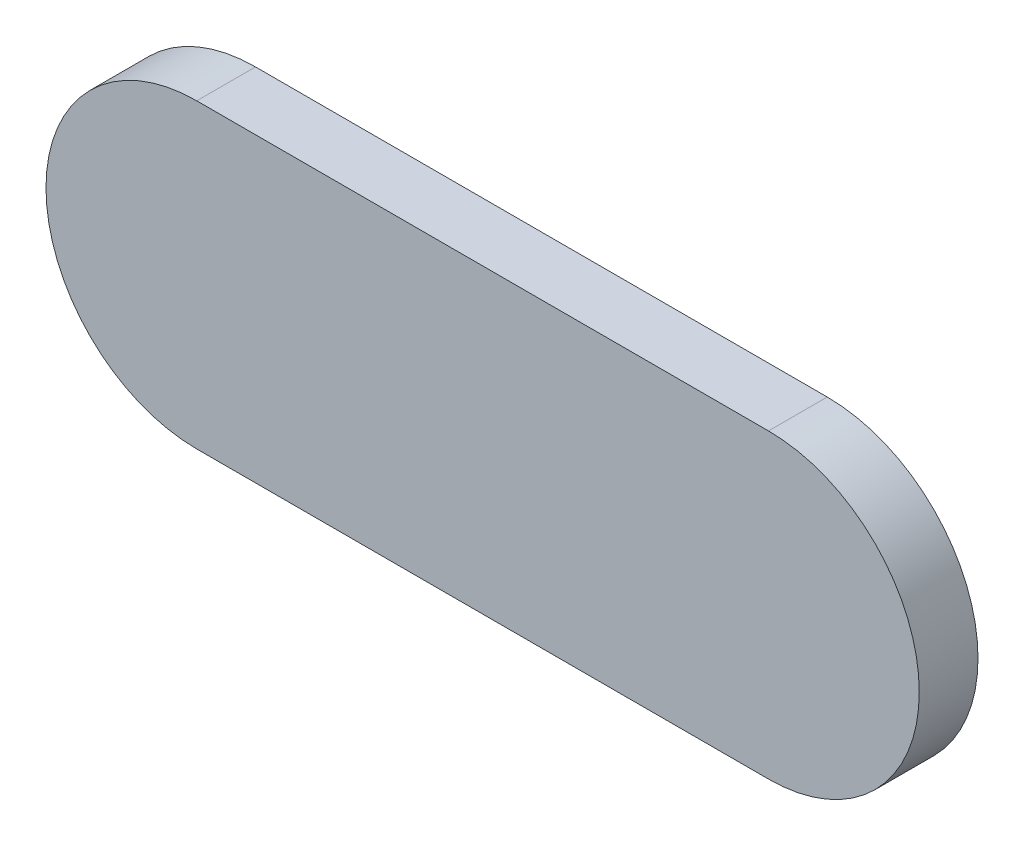
ISO-10303-21;
HEADER;
FILE_DESCRIPTION(('STEP AP214'),'2;1');
FILE_NAME('part.step','',(''),(''),'','','');
FILE_SCHEMA(('AUTOMOTIVE_DESIGN { 1 0 10303 214 1 1 1 1 }'));
ENDSEC;
DATA;
#1=APPLICATION_CONTEXT('core data for automotive mechanical design processes');
#2=APPLICATION_PROTOCOL_DEFINITION('international standard','automotive_design',2000,#1);
#3=PRODUCT_CONTEXT('',#1,'mechanical');
#4=PRODUCT('Part','Part','',(#3));
#5=PRODUCT_RELATED_PRODUCT_CATEGORY('part','',(#4));
#6=PRODUCT_DEFINITION_FORMATION('','',#4);
#7=PRODUCT_DEFINITION_CONTEXT('part definition',#1,'design');
#8=PRODUCT_DEFINITION('design','',#6,#7);
#9=PRODUCT_DEFINITION_SHAPE('','',#8);
#10=(LENGTH_UNIT() NAMED_UNIT(*) SI_UNIT(.MILLI.,.METRE.));
#11=(NAMED_UNIT(*) PLANE_ANGLE_UNIT() SI_UNIT($,.RADIAN.));
#12=(NAMED_UNIT(*) SI_UNIT($,.STERADIAN.) SOLID_ANGLE_UNIT());
#13=UNCERTAINTY_MEASURE_WITH_UNIT(LENGTH_MEASURE(1.E-05),#10,'distance_accuracy_value','');
#14=(GEOMETRIC_REPRESENTATION_CONTEXT(3) GLOBAL_UNCERTAINTY_ASSIGNED_CONTEXT((#13)) GLOBAL_UNIT_ASSIGNED_CONTEXT((#10,
#11,#12)) REPRESENTATION_CONTEXT('',''));
#15=CARTESIAN_POINT('',(0.,0.,0.));
#16=DIRECTION('',(0.,0.,1.));
#17=DIRECTION('',(1.,0.,0.));
#18=AXIS2_PLACEMENT_3D('',#15,#16,#17);
#19=CARTESIAN_POINT('',(7.3,0.,0.));
#20=DIRECTION('',(0.,0.,1.));
#21=DIRECTION('',(1.,0.,0.));
#22=AXIS2_PLACEMENT_3D('',#19,#20,#21);
#23=PLANE('',#22);
#24=CARTESIAN_POINT('',(7.3,0.,0.));
#25=DIRECTION('',(0.,0.,1.));
#26=DIRECTION('',(1.,0.,0.));
#27=AXIS2_PLACEMENT_3D('',#24,#25,#26);
#28=CIRCLE('',#27,3.85);
#29=CARTESIAN_POINT('',(7.3,-3.85,0.));
#30=VERTEX_POINT('',#29);
#31=CARTESIAN_POINT('',(7.3,3.85,0.));
#32=VERTEX_POINT('',#31);
#33=EDGE_CURVE('E121',#30,#32,#28,.T.);
#34=ORIENTED_EDGE('',*,*,#33,.F.);
#35=DIRECTION('',(1.,0.,0.));
#36=VECTOR('',#35,1.);
#37=CARTESIAN_POINT('',(-7.3,-3.85,0.));
#38=LINE('',#37,#36);
#39=CARTESIAN_POINT('',(-7.3,-3.85,0.));
#40=VERTEX_POINT('',#39);
#41=EDGE_CURVE('E134',#40,#30,#38,.T.);
#42=ORIENTED_EDGE('',*,*,#41,.F.);
#43=CARTESIAN_POINT('',(-7.3,0.,0.));
#44=DIRECTION('',(0.,0.,1.));
#45=DIRECTION('',(1.,0.,0.));
#46=AXIS2_PLACEMENT_3D('',#43,#44,#45);
#47=CIRCLE('',#46,3.85);
#48=CARTESIAN_POINT('',(-7.3,3.85,0.));
#49=VERTEX_POINT('',#48);
#50=EDGE_CURVE('E142',#49,#40,#47,.T.);
#51=ORIENTED_EDGE('',*,*,#50,.F.);
#52=DIRECTION('',(-1.,0.,0.));
#53=VECTOR('',#52,1.);
#54=CARTESIAN_POINT('',(7.3,3.85,0.));
#55=LINE('',#54,#53);
#56=EDGE_CURVE('E124',#32,#49,#55,.T.);
#57=ORIENTED_EDGE('',*,*,#56,.F.);
#58=EDGE_LOOP('',(#34,#42,#51,#57));
#59=FACE_BOUND('',#58,.T.);
#60=CARTESIAN_POINT('',(7.35,0.,0.));
#61=DIRECTION('',(0.,0.,-1.));
#62=DIRECTION('',(1.,0.,0.));
#63=AXIS2_PLACEMENT_3D('',#60,#61,#62);
#64=CIRCLE('',#63,2.3);
#65=CARTESIAN_POINT('',(7.35,2.3,0.));
#66=VERTEX_POINT('',#65);
#67=CARTESIAN_POINT('',(7.35,-2.3,0.));
#68=VERTEX_POINT('',#67);
#69=EDGE_CURVE('E51',#66,#68,#64,.T.);
#70=ORIENTED_EDGE('',*,*,#69,.F.);
#71=DIRECTION('',(1.,0.,0.));
#72=VECTOR('',#71,1.);
#73=CARTESIAN_POINT('',(7.35,2.3,0.));
#74=LINE('',#73,#72);
#75=CARTESIAN_POINT('',(-7.35,2.3,0.));
#76=VERTEX_POINT('',#75);
#77=EDGE_CURVE('E55',#76,#66,#74,.T.);
#78=ORIENTED_EDGE('',*,*,#77,.F.);
#79=CARTESIAN_POINT('',(-7.35,0.,0.));
#80=DIRECTION('',(0.,0.,-1.));
#81=DIRECTION('',(-1.,0.,0.));
#82=AXIS2_PLACEMENT_3D('',#79,#80,#81);
#83=CIRCLE('',#82,2.3);
#84=CARTESIAN_POINT('',(-7.35,-2.3,0.));
#85=VERTEX_POINT('',#84);
#86=EDGE_CURVE('E456',#85,#76,#83,.T.);
#87=ORIENTED_EDGE('',*,*,#86,.F.);
#88=DIRECTION('',(-1.,0.,0.));
#89=VECTOR('',#88,1.);
#90=CARTESIAN_POINT('',(7.35,-2.3,0.));
#91=LINE('',#90,#89);
#92=EDGE_CURVE('E458',#68,#85,#91,.T.);
#93=ORIENTED_EDGE('',*,*,#92,.F.);
#94=EDGE_LOOP('',(#70,#78,#87,#93));
#95=FACE_BOUND('',#94,.T.);
#96=ADVANCED_FACE('F36',(#59,#95),#23,.F.);
#97=CARTESIAN_POINT('',(7.3,0.,1.5));
#98=DIRECTION('',(0.,0.,-1.));
#99=DIRECTION('',(-1.,0.,0.));
#100=AXIS2_PLACEMENT_3D('',#97,#98,#99);
#101=CYLINDRICAL_SURFACE('',#100,3.85);
#102=ORIENTED_EDGE('',*,*,#33,.T.);
#103=DIRECTION('',(0.,0.,-1.));
#104=VECTOR('',#103,1.);
#105=CARTESIAN_POINT('',(7.3,3.85,1.5));
#106=LINE('',#105,#104);
#107=CARTESIAN_POINT('',(7.3,3.85,1.5));
#108=VERTEX_POINT('',#107);
#109=EDGE_CURVE('E153',#108,#32,#106,.T.);
#110=ORIENTED_EDGE('',*,*,#109,.F.);
#111=CARTESIAN_POINT('',(7.3,0.,1.5));
#112=DIRECTION('',(0.,0.,1.));
#113=DIRECTION('',(1.,0.,0.));
#114=AXIS2_PLACEMENT_3D('',#111,#112,#113);
#115=CIRCLE('',#114,3.85);
#116=CARTESIAN_POINT('',(7.3,-3.85,1.5));
#117=VERTEX_POINT('',#116);
#118=EDGE_CURVE('E130',#117,#108,#115,.T.);
#119=ORIENTED_EDGE('',*,*,#118,.F.);
#120=DIRECTION('',(0.,0.,-1.));
#121=VECTOR('',#120,1.);
#122=CARTESIAN_POINT('',(7.3,-3.85,1.5));
#123=LINE('',#122,#121);
#124=EDGE_CURVE('E139',#117,#30,#123,.T.);
#125=ORIENTED_EDGE('',*,*,#124,.T.);
#126=EDGE_LOOP('',(#102,#110,#119,#125));
#127=FACE_BOUND('',#126,.T.);
#128=ADVANCED_FACE('F200',(#127),#101,.T.);
#129=CARTESIAN_POINT('',(7.3,3.85,1.5));
#130=DIRECTION('',(0.,-1.,0.));
#131=DIRECTION('',(1.,0.,0.));
#132=AXIS2_PLACEMENT_3D('',#129,#130,#131);
#133=PLANE('',#132);
#134=ORIENTED_EDGE('',*,*,#56,.T.);
#135=DIRECTION('',(0.,0.,-1.));
#136=VECTOR('',#135,1.);
#137=CARTESIAN_POINT('',(-7.3,3.85,1.5));
#138=LINE('',#137,#136);
#139=CARTESIAN_POINT('',(-7.3,3.85,1.5));
#140=VERTEX_POINT('',#139);
#141=EDGE_CURVE('E150',#140,#49,#138,.T.);
#142=ORIENTED_EDGE('',*,*,#141,.F.);
#143=DIRECTION('',(-1.,0.,0.));
#144=VECTOR('',#143,1.);
#145=CARTESIAN_POINT('',(7.3,3.85,1.5));
#146=LINE('',#145,#144);
#147=EDGE_CURVE('E133',#108,#140,#146,.T.);
#148=ORIENTED_EDGE('',*,*,#147,.F.);
#149=ORIENTED_EDGE('',*,*,#109,.T.);
#150=EDGE_LOOP('',(#134,#142,#148,#149));
#151=FACE_BOUND('',#150,.T.);
#152=ADVANCED_FACE('F206',(#151),#133,.F.);
#153=CARTESIAN_POINT('',(-7.3,0.,1.5));
#154=DIRECTION('',(0.,0.,-1.));
#155=DIRECTION('',(-1.,0.,0.));
#156=AXIS2_PLACEMENT_3D('',#153,#154,#155);
#157=CYLINDRICAL_SURFACE('',#156,3.85);
#158=ORIENTED_EDGE('',*,*,#50,.T.);
#159=DIRECTION('',(0.,0.,-1.));
#160=VECTOR('',#159,1.);
#161=CARTESIAN_POINT('',(-7.3,-3.85,1.5));
#162=LINE('',#161,#160);
#163=CARTESIAN_POINT('',(-7.3,-3.85,1.5));
#164=VERTEX_POINT('',#163);
#165=EDGE_CURVE('E147',#164,#40,#162,.T.);
#166=ORIENTED_EDGE('',*,*,#165,.F.);
#167=CARTESIAN_POINT('',(-7.3,0.,1.5));
#168=DIRECTION('',(0.,0.,1.));
#169=DIRECTION('',(1.,0.,0.));
#170=AXIS2_PLACEMENT_3D('',#167,#168,#169);
#171=CIRCLE('',#170,3.85);
#172=EDGE_CURVE('E136',#140,#164,#171,.T.);
#173=ORIENTED_EDGE('',*,*,#172,.F.);
#174=ORIENTED_EDGE('',*,*,#141,.T.);
#175=EDGE_LOOP('',(#158,#166,#173,#174));
#176=FACE_BOUND('',#175,.T.);
#177=ADVANCED_FACE('F217',(#176),#157,.T.);
#178=CARTESIAN_POINT('',(-7.3,-3.85,1.5));
#179=DIRECTION('',(0.,1.,0.));
#180=DIRECTION('',(0.,0.,1.));
#181=AXIS2_PLACEMENT_3D('',#178,#179,#180);
#182=PLANE('',#181);
#183=ORIENTED_EDGE('',*,*,#41,.T.);
#184=ORIENTED_EDGE('',*,*,#124,.F.);
#185=DIRECTION('',(1.,0.,0.));
#186=VECTOR('',#185,1.);
#187=CARTESIAN_POINT('',(-7.3,-3.85,1.5));
#188=LINE('',#187,#186);
#189=EDGE_CURVE('E138',#164,#117,#188,.T.);
#190=ORIENTED_EDGE('',*,*,#189,.F.);
#191=ORIENTED_EDGE('',*,*,#165,.T.);
#192=EDGE_LOOP('',(#183,#184,#190,#191));
#193=FACE_BOUND('',#192,.T.);
#194=ADVANCED_FACE('F214',(#193),#182,.F.);
#195=CARTESIAN_POINT('',(7.3,0.,1.5));
#196=DIRECTION('',(0.,0.,1.));
#197=DIRECTION('',(1.,0.,0.));
#198=AXIS2_PLACEMENT_3D('',#195,#196,#197);
#199=PLANE('',#198);
#200=ORIENTED_EDGE('',*,*,#118,.T.);
#201=ORIENTED_EDGE('',*,*,#147,.T.);
#202=ORIENTED_EDGE('',*,*,#172,.T.);
#203=ORIENTED_EDGE('',*,*,#189,.T.);
#204=EDGE_LOOP('',(#200,#201,#202,#203));
#205=FACE_BOUND('',#204,.T.);
#206=ADVANCED_FACE('F212',(#205),#199,.T.);
#207=CARTESIAN_POINT('',(7.35,0.,-0.5));
#208=DIRECTION('',(0.,0.,1.));
#209=DIRECTION('',(1.,0.,0.));
#210=AXIS2_PLACEMENT_3D('',#207,#208,#209);
#211=CYLINDRICAL_SURFACE('',#210,2.3);
#212=ORIENTED_EDGE('',*,*,#69,.T.);
#213=DIRECTION('',(0.,0.,1.));
#214=VECTOR('',#213,1.);
#215=CARTESIAN_POINT('',(7.35,-2.3,-0.5));
#216=LINE('',#215,#214);
#217=CARTESIAN_POINT('',(7.35,-2.3,-0.5));
#218=VERTEX_POINT('',#217);
#219=EDGE_CURVE('E104',#218,#68,#216,.T.);
#220=ORIENTED_EDGE('',*,*,#219,.F.);
#221=CARTESIAN_POINT('',(7.35,0.,-0.5));
#222=DIRECTION('',(0.,0.,-1.));
#223=DIRECTION('',(1.,0.,0.));
#224=AXIS2_PLACEMENT_3D('',#221,#222,#223);
#225=CIRCLE('',#224,2.3);
#226=CARTESIAN_POINT('',(7.35,2.3,-0.5));
#227=VERTEX_POINT('',#226);
#228=EDGE_CURVE('E110',#227,#218,#225,.T.);
#229=ORIENTED_EDGE('',*,*,#228,.F.);
#230=DIRECTION('',(0.,0.,1.));
#231=VECTOR('',#230,1.);
#232=CARTESIAN_POINT('',(7.35,2.3,-0.5));
#233=LINE('',#232,#231);
#234=EDGE_CURVE('E460',#227,#66,#233,.T.);
#235=ORIENTED_EDGE('',*,*,#234,.T.);
#236=EDGE_LOOP('',(#212,#220,#229,#235));
#237=FACE_BOUND('',#236,.T.);
#238=ADVANCED_FACE('F120',(#237),#211,.T.);
#239=CARTESIAN_POINT('',(7.35,-2.3,-0.5));
#240=DIRECTION('',(0.,1.,0.));
#241=DIRECTION('',(0.,0.,1.));
#242=AXIS2_PLACEMENT_3D('',#239,#240,#241);
#243=PLANE('',#242);
#244=ORIENTED_EDGE('',*,*,#92,.T.);
#245=DIRECTION('',(0.,0.,1.));
#246=VECTOR('',#245,1.);
#247=CARTESIAN_POINT('',(-7.35,-2.3,-0.5));
#248=LINE('',#247,#246);
#249=CARTESIAN_POINT('',(-7.35,-2.3,-0.5));
#250=VERTEX_POINT('',#249);
#251=EDGE_CURVE('E106',#250,#85,#248,.T.);
#252=ORIENTED_EDGE('',*,*,#251,.F.);
#253=DIRECTION('',(-1.,0.,0.));
#254=VECTOR('',#253,1.);
#255=CARTESIAN_POINT('',(7.35,-2.3,-0.5));
#256=LINE('',#255,#254);
#257=EDGE_CURVE('E99',#218,#250,#256,.T.);
#258=ORIENTED_EDGE('',*,*,#257,.F.);
#259=ORIENTED_EDGE('',*,*,#219,.T.);
#260=EDGE_LOOP('',(#244,#252,#258,#259));
#261=FACE_BOUND('',#260,.T.);
#262=ADVANCED_FACE('F102',(#261),#243,.F.);
#263=CARTESIAN_POINT('',(-7.35,0.,-0.5));
#264=DIRECTION('',(0.,0.,1.));
#265=DIRECTION('',(1.,0.,0.));
#266=AXIS2_PLACEMENT_3D('',#263,#264,#265);
#267=CYLINDRICAL_SURFACE('',#266,2.3);
#268=ORIENTED_EDGE('',*,*,#86,.T.);
#269=DIRECTION('',(0.,0.,1.));
#270=VECTOR('',#269,1.);
#271=CARTESIAN_POINT('',(-7.35,2.3,-0.5));
#272=LINE('',#271,#270);
#273=CARTESIAN_POINT('',(-7.35,2.3,-0.5));
#274=VERTEX_POINT('',#273);
#275=EDGE_CURVE('E126',#274,#76,#272,.T.);
#276=ORIENTED_EDGE('',*,*,#275,.F.);
#277=CARTESIAN_POINT('',(-7.35,0.,-0.5));
#278=DIRECTION('',(0.,0.,-1.));
#279=DIRECTION('',(-1.,0.,0.));
#280=AXIS2_PLACEMENT_3D('',#277,#278,#279);
#281=CIRCLE('',#280,2.3);
#282=EDGE_CURVE('E109',#250,#274,#281,.T.);
#283=ORIENTED_EDGE('',*,*,#282,.F.);
#284=ORIENTED_EDGE('',*,*,#251,.T.);
#285=EDGE_LOOP('',(#268,#276,#283,#284));
#286=FACE_BOUND('',#285,.T.);
#287=ADVANCED_FACE('F260',(#286),#267,.T.);
#288=CARTESIAN_POINT('',(7.35,2.3,-0.5));
#289=DIRECTION('',(0.,-1.,0.));
#290=DIRECTION('',(0.,0.,-1.));
#291=AXIS2_PLACEMENT_3D('',#288,#289,#290);
#292=PLANE('',#291);
#293=ORIENTED_EDGE('',*,*,#77,.T.);
#294=ORIENTED_EDGE('',*,*,#234,.F.);
#295=DIRECTION('',(1.,0.,0.));
#296=VECTOR('',#295,1.);
#297=CARTESIAN_POINT('',(7.35,2.3,-0.5));
#298=LINE('',#297,#296);
#299=EDGE_CURVE('E115',#274,#227,#298,.T.);
#300=ORIENTED_EDGE('',*,*,#299,.F.);
#301=ORIENTED_EDGE('',*,*,#275,.T.);
#302=EDGE_LOOP('',(#293,#294,#300,#301));
#303=FACE_BOUND('',#302,.T.);
#304=ADVANCED_FACE('F256',(#303),#292,.F.);
#305=CARTESIAN_POINT('',(7.35,0.,-0.5));
#306=DIRECTION('',(0.,0.,1.));
#307=DIRECTION('',(1.,0.,0.));
#308=AXIS2_PLACEMENT_3D('',#305,#306,#307);
#309=PLANE('',#308);
#310=CARTESIAN_POINT('',(1.27,0.,-0.5));
#311=DIRECTION('',(0.,0.,1.));
#312=DIRECTION('',(1.,0.,0.));
#313=AXIS2_PLACEMENT_3D('',#310,#311,#312);
#314=CIRCLE('',#313,0.75);
#315=CARTESIAN_POINT('',(2.02,0.,-0.5));
#316=VERTEX_POINT('',#315);
#317=EDGE_CURVE('E165',#316,#316,#314,.F.);
#318=ORIENTED_EDGE('',*,*,#317,.F.);
#319=EDGE_LOOP('',(#318));
#320=FACE_BOUND('',#319,.T.);
#321=CARTESIAN_POINT('',(3.81,0.,-0.5));
#322=DIRECTION('',(0.,0.,1.));
#323=DIRECTION('',(1.,0.,0.));
#324=AXIS2_PLACEMENT_3D('',#321,#322,#323);
#325=CIRCLE('',#324,0.750000000000001);
#326=CARTESIAN_POINT('',(4.56,0.,-0.5));
#327=VERTEX_POINT('',#326);
#328=EDGE_CURVE('E162',#327,#327,#325,.F.);
#329=ORIENTED_EDGE('',*,*,#328,.F.);
#330=EDGE_LOOP('',(#329));
#331=FACE_BOUND('',#330,.T.);
#332=CARTESIAN_POINT('',(-3.81,0.,-0.5));
#333=DIRECTION('',(0.,0.,1.));
#334=DIRECTION('',(1.,0.,0.));
#335=AXIS2_PLACEMENT_3D('',#332,#333,#334);
#336=CIRCLE('',#335,0.750000000000001);
#337=CARTESIAN_POINT('',(-3.06,0.,-0.5));
#338=VERTEX_POINT('',#337);
#339=EDGE_CURVE('E159',#338,#338,#336,.F.);
#340=ORIENTED_EDGE('',*,*,#339,.F.);
#341=EDGE_LOOP('',(#340));
#342=FACE_BOUND('',#341,.T.);
#343=CARTESIAN_POINT('',(-1.27,0.,-0.5));
#344=DIRECTION('',(0.,0.,1.));
#345=DIRECTION('',(1.,0.,0.));
#346=AXIS2_PLACEMENT_3D('',#343,#344,#345);
#347=CIRCLE('',#346,0.75);
#348=CARTESIAN_POINT('',(-0.52,0.,-0.5));
#349=VERTEX_POINT('',#348);
#350=EDGE_CURVE('E156',#349,#349,#347,.F.);
#351=ORIENTED_EDGE('',*,*,#350,.F.);
#352=EDGE_LOOP('',(#351));
#353=FACE_BOUND('',#352,.T.);
#354=ORIENTED_EDGE('',*,*,#228,.T.);
#355=ORIENTED_EDGE('',*,*,#257,.T.);
#356=ORIENTED_EDGE('',*,*,#282,.T.);
#357=ORIENTED_EDGE('',*,*,#299,.T.);
#358=EDGE_LOOP('',(#354,#355,#356,#357));
#359=FACE_BOUND('',#358,.T.);
#360=ADVANCED_FACE('F113',(#320,#331,#342,#353,#359),#309,.F.);
#361=CARTESIAN_POINT('',(-1.27,0.,-1.5));
#362=DIRECTION('',(0.,0.,1.));
#363=DIRECTION('',(1.,0.,0.));
#364=AXIS2_PLACEMENT_3D('',#361,#362,#363);
#365=CYLINDRICAL_SURFACE('',#364,0.75);
#366=CARTESIAN_POINT('',(-1.27,0.,-1.));
#367=DIRECTION('',(0.,0.,-1.));
#368=DIRECTION('',(-1.,0.,0.));
#369=AXIS2_PLACEMENT_3D('',#366,#367,#368);
#370=CIRCLE('',#369,0.75);
#371=CARTESIAN_POINT('',(-2.02,0.,-1.));
#372=VERTEX_POINT('',#371);
#373=EDGE_CURVE('E177',#372,#372,#370,.F.);
#374=ORIENTED_EDGE('',*,*,#373,.T.);
#375=EDGE_LOOP('',(#374));
#376=FACE_BOUND('',#375,.T.);
#377=ORIENTED_EDGE('',*,*,#350,.T.);
#378=EDGE_LOOP('',(#377));
#379=FACE_BOUND('',#378,.T.);
#380=ADVANCED_FACE('F241',(#376,#379),#365,.T.);
#381=CARTESIAN_POINT('',(-1.27,0.,-1.5));
#382=DIRECTION('',(0.,0.,-1.));
#383=DIRECTION('',(-1.,0.,0.));
#384=AXIS2_PLACEMENT_3D('',#381,#382,#383);
#385=PLANE('',#384);
#386=CARTESIAN_POINT('',(-1.27,0.,-1.5));
#387=DIRECTION('',(0.,0.,-1.));
#388=DIRECTION('',(-1.,0.,0.));
#389=AXIS2_PLACEMENT_3D('',#386,#387,#388);
#390=CIRCLE('',#389,0.25);
#391=CARTESIAN_POINT('',(-1.52,0.,-1.5));
#392=VERTEX_POINT('',#391);
#393=EDGE_CURVE('E174',#392,#392,#390,.T.);
#394=ORIENTED_EDGE('',*,*,#393,.T.);
#395=EDGE_LOOP('',(#394));
#396=FACE_BOUND('',#395,.T.);
#397=ADVANCED_FACE('F238',(#396),#385,.T.);
#398=CARTESIAN_POINT('',(-3.81,0.,-1.5));
#399=DIRECTION('',(0.,0.,1.));
#400=DIRECTION('',(1.,0.,0.));
#401=AXIS2_PLACEMENT_3D('',#398,#399,#400);
#402=CYLINDRICAL_SURFACE('',#401,0.750000000000001);
#403=CARTESIAN_POINT('',(-3.81,0.,-1.));
#404=DIRECTION('',(0.,0.,-1.));
#405=DIRECTION('',(-1.,0.,0.));
#406=AXIS2_PLACEMENT_3D('',#403,#404,#405);
#407=CIRCLE('',#406,0.750000000000001);
#408=CARTESIAN_POINT('',(-4.56,0.,-1.));
#409=VERTEX_POINT('',#408);
#410=EDGE_CURVE('E171',#409,#409,#407,.F.);
#411=ORIENTED_EDGE('',*,*,#410,.T.);
#412=EDGE_LOOP('',(#411));
#413=FACE_BOUND('',#412,.T.);
#414=ORIENTED_EDGE('',*,*,#339,.T.);
#415=EDGE_LOOP('',(#414));
#416=FACE_BOUND('',#415,.T.);
#417=ADVANCED_FACE('F240',(#413,#416),#402,.T.);
#418=CARTESIAN_POINT('',(-3.81,0.,-1.5));
#419=DIRECTION('',(0.,0.,-1.));
#420=DIRECTION('',(-1.,0.,0.));
#421=AXIS2_PLACEMENT_3D('',#418,#419,#420);
#422=PLANE('',#421);
#423=CARTESIAN_POINT('',(-3.81,0.,-1.5));
#424=DIRECTION('',(0.,0.,-1.));
#425=DIRECTION('',(-1.,0.,0.));
#426=AXIS2_PLACEMENT_3D('',#423,#424,#425);
#427=CIRCLE('',#426,0.250000000000001);
#428=CARTESIAN_POINT('',(-4.06,0.,-1.5));
#429=VERTEX_POINT('',#428);
#430=EDGE_CURVE('E168',#429,#429,#427,.T.);
#431=ORIENTED_EDGE('',*,*,#430,.T.);
#432=EDGE_LOOP('',(#431));
#433=FACE_BOUND('',#432,.T.);
#434=ADVANCED_FACE('F247',(#433),#422,.T.);
#435=CARTESIAN_POINT('',(3.81,0.,-1.5));
#436=DIRECTION('',(0.,0.,1.));
#437=DIRECTION('',(1.,0.,0.));
#438=AXIS2_PLACEMENT_3D('',#435,#436,#437);
#439=CYLINDRICAL_SURFACE('',#438,0.750000000000001);
#440=CARTESIAN_POINT('',(3.81,0.,-1.));
#441=DIRECTION('',(0.,0.,1.));
#442=DIRECTION('',(1.,0.,0.));
#443=AXIS2_PLACEMENT_3D('',#440,#441,#442);
#444=CIRCLE('',#443,0.750000000000001);
#445=CARTESIAN_POINT('',(4.56,0.,-1.));
#446=VERTEX_POINT('',#445);
#447=EDGE_CURVE('E11',#446,#446,#444,.T.);
#448=ORIENTED_EDGE('',*,*,#447,.T.);
#449=EDGE_LOOP('',(#448));
#450=FACE_BOUND('',#449,.T.);
#451=ORIENTED_EDGE('',*,*,#328,.T.);
#452=EDGE_LOOP('',(#451));
#453=FACE_BOUND('',#452,.T.);
#454=ADVANCED_FACE('F360',(#450,#453),#439,.T.);
#455=CARTESIAN_POINT('',(3.81,0.,-1.5));
#456=DIRECTION('',(0.,0.,1.));
#457=DIRECTION('',(1.,0.,0.));
#458=AXIS2_PLACEMENT_3D('',#455,#456,#457);
#459=PLANE('',#458);
#460=CARTESIAN_POINT('',(3.81,0.,-1.5));
#461=DIRECTION('',(0.,0.,1.));
#462=DIRECTION('',(1.,0.,0.));
#463=AXIS2_PLACEMENT_3D('',#460,#461,#462);
#464=CIRCLE('',#463,0.250000000000001);
#465=CARTESIAN_POINT('',(4.06,0.,-1.5));
#466=VERTEX_POINT('',#465);
#467=EDGE_CURVE('E44',#466,#466,#464,.F.);
#468=ORIENTED_EDGE('',*,*,#467,.T.);
#469=EDGE_LOOP('',(#468));
#470=FACE_BOUND('',#469,.T.);
#471=ADVANCED_FACE('F188',(#470),#459,.F.);
#472=CARTESIAN_POINT('',(1.27,0.,-1.5));
#473=DIRECTION('',(0.,0.,1.));
#474=DIRECTION('',(1.,0.,0.));
#475=AXIS2_PLACEMENT_3D('',#472,#473,#474);
#476=CYLINDRICAL_SURFACE('',#475,0.75);
#477=CARTESIAN_POINT('',(1.27,0.,-1.));
#478=DIRECTION('',(0.,0.,1.));
#479=DIRECTION('',(1.,0.,0.));
#480=AXIS2_PLACEMENT_3D('',#477,#478,#479);
#481=CIRCLE('',#480,0.75);
#482=CARTESIAN_POINT('',(2.02,0.,-1.));
#483=VERTEX_POINT('',#482);
#484=EDGE_CURVE('E183',#483,#483,#481,.T.);
#485=ORIENTED_EDGE('',*,*,#484,.T.);
#486=EDGE_LOOP('',(#485));
#487=FACE_BOUND('',#486,.T.);
#488=ORIENTED_EDGE('',*,*,#317,.T.);
#489=EDGE_LOOP('',(#488));
#490=FACE_BOUND('',#489,.T.);
#491=ADVANCED_FACE('F377',(#487,#490),#476,.T.);
#492=CARTESIAN_POINT('',(1.27,0.,-1.5));
#493=DIRECTION('',(0.,0.,1.));
#494=DIRECTION('',(1.,0.,0.));
#495=AXIS2_PLACEMENT_3D('',#492,#493,#494);
#496=PLANE('',#495);
#497=CARTESIAN_POINT('',(1.27,0.,-1.5));
#498=DIRECTION('',(0.,0.,1.));
#499=DIRECTION('',(1.,0.,0.));
#500=AXIS2_PLACEMENT_3D('',#497,#498,#499);
#501=CIRCLE('',#500,0.25);
#502=CARTESIAN_POINT('',(1.52,0.,-1.5));
#503=VERTEX_POINT('',#502);
#504=EDGE_CURVE('E180',#503,#503,#501,.F.);
#505=ORIENTED_EDGE('',*,*,#504,.T.);
#506=EDGE_LOOP('',(#505));
#507=FACE_BOUND('',#506,.T.);
#508=ADVANCED_FACE('F228',(#507),#496,.F.);
#509=CARTESIAN_POINT('',(-3.81,0.,-1.));
#510=DIRECTION('',(0.,0.,-1.));
#511=DIRECTION('',(-1.,0.,0.));
#512=AXIS2_PLACEMENT_3D('',#509,#510,#511);
#513=DEGENERATE_TOROIDAL_SURFACE('',#512,0.250000000000001,0.5,.T.);
#514=ORIENTED_EDGE('',*,*,#410,.F.);
#515=EDGE_LOOP('',(#514));
#516=FACE_BOUND('',#515,.T.);
#517=ORIENTED_EDGE('',*,*,#430,.F.);
#518=EDGE_LOOP('',(#517));
#519=FACE_BOUND('',#518,.T.);
#520=ADVANCED_FACE('F225',(#516,#519),#513,.T.);
#521=CARTESIAN_POINT('',(-1.27,0.,-1.));
#522=DIRECTION('',(0.,0.,-1.));
#523=DIRECTION('',(-1.,0.,0.));
#524=AXIS2_PLACEMENT_3D('',#521,#522,#523);
#525=DEGENERATE_TOROIDAL_SURFACE('',#524,0.25,0.5,.T.);
#526=ORIENTED_EDGE('',*,*,#373,.F.);
#527=EDGE_LOOP('',(#526));
#528=FACE_BOUND('',#527,.T.);
#529=ORIENTED_EDGE('',*,*,#393,.F.);
#530=EDGE_LOOP('',(#529));
#531=FACE_BOUND('',#530,.T.);
#532=ADVANCED_FACE('F196',(#528,#531),#525,.T.);
#533=CARTESIAN_POINT('',(1.27,0.,-1.));
#534=DIRECTION('',(0.,0.,1.));
#535=DIRECTION('',(1.,0.,0.));
#536=AXIS2_PLACEMENT_3D('',#533,#534,#535);
#537=DEGENERATE_TOROIDAL_SURFACE('',#536,0.25,0.5,.T.);
#538=ORIENTED_EDGE('',*,*,#484,.F.);
#539=EDGE_LOOP('',(#538));
#540=FACE_BOUND('',#539,.T.);
#541=ORIENTED_EDGE('',*,*,#504,.F.);
#542=EDGE_LOOP('',(#541));
#543=FACE_BOUND('',#542,.T.);
#544=ADVANCED_FACE('F191',(#540,#543),#537,.T.);
#545=CARTESIAN_POINT('',(3.81,0.,-1.));
#546=DIRECTION('',(0.,0.,1.));
#547=DIRECTION('',(1.,0.,0.));
#548=AXIS2_PLACEMENT_3D('',#545,#546,#547);
#549=DEGENERATE_TOROIDAL_SURFACE('',#548,0.250000000000001,0.5,.T.);
#550=ORIENTED_EDGE('',*,*,#447,.F.);
#551=EDGE_LOOP('',(#550));
#552=FACE_BOUND('',#551,.T.);
#553=ORIENTED_EDGE('',*,*,#467,.F.);
#554=EDGE_LOOP('',(#553));
#555=FACE_BOUND('',#554,.T.);
#556=ADVANCED_FACE('F38',(#552,#555),#549,.T.);
#557=CLOSED_SHELL('',(#96,#128,#152,#177,#194,#206,#238,#262,#287,#304,#360,#380,#397,#417,#434,
#454,#471,#491,#508,#520,#532,#544,#556));
#558=MANIFOLD_SOLID_BREP('B2',#557);
#559=ADVANCED_BREP_SHAPE_REPRESENTATION('',(#18,#558),#14);
#560=SHAPE_DEFINITION_REPRESENTATION(#9,#559);
ENDSEC;
END-ISO-10303-21;
